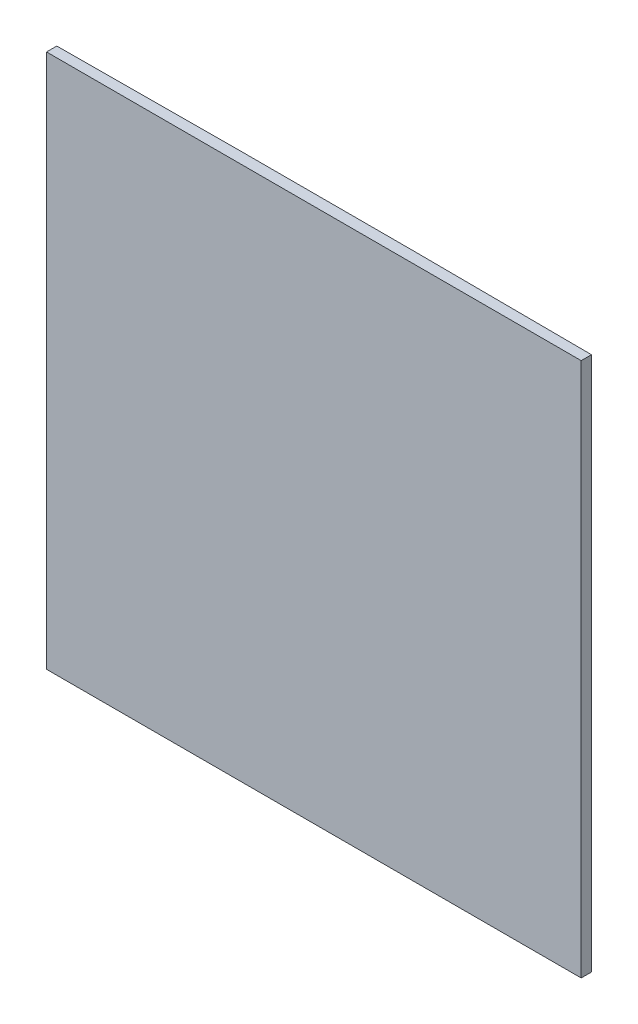
ISO-10303-21;
HEADER;
FILE_DESCRIPTION(('STEP AP214'),'2;1');
FILE_NAME('part.step','',(''),(''),'','','');
FILE_SCHEMA(('AUTOMOTIVE_DESIGN { 1 0 10303 214 1 1 1 1 }'));
ENDSEC;
DATA;
#1=APPLICATION_CONTEXT('core data for automotive mechanical design processes');
#2=APPLICATION_PROTOCOL_DEFINITION('international standard','automotive_design',2000,#1);
#3=PRODUCT_CONTEXT('',#1,'mechanical');
#4=PRODUCT('Part','Part','',(#3));
#5=PRODUCT_RELATED_PRODUCT_CATEGORY('part','',(#4));
#6=PRODUCT_DEFINITION_FORMATION('','',#4);
#7=PRODUCT_DEFINITION_CONTEXT('part definition',#1,'design');
#8=PRODUCT_DEFINITION('design','',#6,#7);
#9=PRODUCT_DEFINITION_SHAPE('','',#8);
#10=(LENGTH_UNIT() NAMED_UNIT(*) SI_UNIT(.MILLI.,.METRE.));
#11=(NAMED_UNIT(*) PLANE_ANGLE_UNIT() SI_UNIT($,.RADIAN.));
#12=(NAMED_UNIT(*) SI_UNIT($,.STERADIAN.) SOLID_ANGLE_UNIT());
#13=UNCERTAINTY_MEASURE_WITH_UNIT(LENGTH_MEASURE(1.E-05),#10,'distance_accuracy_value','');
#14=(GEOMETRIC_REPRESENTATION_CONTEXT(3) GLOBAL_UNCERTAINTY_ASSIGNED_CONTEXT((#13)) GLOBAL_UNIT_ASSIGNED_CONTEXT((#10,
#11,#12)) REPRESENTATION_CONTEXT('',''));
#15=CARTESIAN_POINT('',(0.,0.,0.));
#16=DIRECTION('',(0.,0.,1.));
#17=DIRECTION('',(1.,0.,0.));
#18=AXIS2_PLACEMENT_3D('',#15,#16,#17);
#19=CARTESIAN_POINT('',(0.,52.,-1.));
#20=DIRECTION('',(1.,0.,0.));
#21=DIRECTION('',(0.,0.,-1.));
#22=AXIS2_PLACEMENT_3D('',#19,#20,#21);
#23=PLANE('',#22);
#24=DIRECTION('',(0.,0.,1.));
#25=VECTOR('',#24,1.);
#26=CARTESIAN_POINT('',(0.,0.,-1.));
#27=LINE('',#26,#25);
#28=CARTESIAN_POINT('',(2.18575157973078E-13,0.,-1.00000000000033));
#29=VERTEX_POINT('',#28);
#30=CARTESIAN_POINT('',(0.,0.,0.));
#31=VERTEX_POINT('',#30);
#32=EDGE_CURVE('E97',#29,#31,#27,.T.);
#33=ORIENTED_EDGE('',*,*,#32,.T.);
#34=DIRECTION('',(0.,-1.,0.));
#35=VECTOR('',#34,1.);
#36=CARTESIAN_POINT('',(0.,52.,0.));
#37=LINE('',#36,#35);
#38=CARTESIAN_POINT('',(0.,52.,0.));
#39=VERTEX_POINT('',#38);
#40=EDGE_CURVE('E11',#39,#31,#37,.T.);
#41=ORIENTED_EDGE('',*,*,#40,.F.);
#42=DIRECTION('',(0.,0.,1.));
#43=VECTOR('',#42,1.);
#44=CARTESIAN_POINT('',(0.,52.,-1.));
#45=LINE('',#44,#43);
#46=CARTESIAN_POINT('',(2.18575157973078E-13,52.,-1.00000000000033));
#47=VERTEX_POINT('',#46);
#48=EDGE_CURVE('E85',#47,#39,#45,.T.);
#49=ORIENTED_EDGE('',*,*,#48,.F.);
#50=DIRECTION('',(0.,-1.,0.));
#51=VECTOR('',#50,1.);
#52=CARTESIAN_POINT('',(2.18575157973078E-13,52.,-1.00000000000033));
#53=LINE('',#52,#51);
#54=EDGE_CURVE('E93',#47,#29,#53,.T.);
#55=ORIENTED_EDGE('',*,*,#54,.T.);
#56=EDGE_LOOP('',(#33,#41,#49,#55));
#57=FACE_BOUND('',#56,.T.);
#58=ADVANCED_FACE('F34',(#57),#23,.F.);
#59=CARTESIAN_POINT('',(0.,52.,0.));
#60=DIRECTION('',(0.,0.,-1.));
#61=DIRECTION('',(-1.,0.,0.));
#62=AXIS2_PLACEMENT_3D('',#59,#60,#61);
#63=PLANE('',#62);
#64=DIRECTION('',(1.,0.,0.));
#65=VECTOR('',#64,1.);
#66=CARTESIAN_POINT('',(0.,0.,0.));
#67=LINE('',#66,#65);
#68=CARTESIAN_POINT('',(52.,0.,0.));
#69=VERTEX_POINT('',#68);
#70=EDGE_CURVE('E89',#31,#69,#67,.T.);
#71=ORIENTED_EDGE('',*,*,#70,.T.);
#72=DIRECTION('',(0.,-1.,0.));
#73=VECTOR('',#72,1.);
#74=CARTESIAN_POINT('',(52.,52.,0.));
#75=LINE('',#74,#73);
#76=CARTESIAN_POINT('',(52.,52.,0.));
#77=VERTEX_POINT('',#76);
#78=EDGE_CURVE('E42',#77,#69,#75,.T.);
#79=ORIENTED_EDGE('',*,*,#78,.F.);
#80=DIRECTION('',(1.,0.,0.));
#81=VECTOR('',#80,1.);
#82=CARTESIAN_POINT('',(0.,52.,0.));
#83=LINE('',#82,#81);
#84=EDGE_CURVE('E80',#39,#77,#83,.T.);
#85=ORIENTED_EDGE('',*,*,#84,.F.);
#86=ORIENTED_EDGE('',*,*,#40,.T.);
#87=EDGE_LOOP('',(#71,#79,#85,#86));
#88=FACE_BOUND('',#87,.T.);
#89=ADVANCED_FACE('F88',(#88),#63,.F.);
#90=CARTESIAN_POINT('',(52.,52.,0.));
#91=DIRECTION('',(-1.,0.,0.));
#92=DIRECTION('',(0.,0.,1.));
#93=AXIS2_PLACEMENT_3D('',#90,#91,#92);
#94=PLANE('',#93);
#95=DIRECTION('',(0.,0.,-1.));
#96=VECTOR('',#95,1.);
#97=CARTESIAN_POINT('',(52.,0.,0.));
#98=LINE('',#97,#96);
#99=CARTESIAN_POINT('',(52.,0.,-1.));
#100=VERTEX_POINT('',#99);
#101=EDGE_CURVE('E67',#69,#100,#98,.T.);
#102=ORIENTED_EDGE('',*,*,#101,.T.);
#103=DIRECTION('',(0.,-1.,0.));
#104=VECTOR('',#103,1.);
#105=CARTESIAN_POINT('',(52.,52.,-1.));
#106=LINE('',#105,#104);
#107=CARTESIAN_POINT('',(52.,52.,-1.));
#108=VERTEX_POINT('',#107);
#109=EDGE_CURVE('E90',#108,#100,#106,.T.);
#110=ORIENTED_EDGE('',*,*,#109,.F.);
#111=DIRECTION('',(0.,0.,-1.));
#112=VECTOR('',#111,1.);
#113=CARTESIAN_POINT('',(52.,52.,0.));
#114=LINE('',#113,#112);
#115=EDGE_CURVE('E83',#77,#108,#114,.T.);
#116=ORIENTED_EDGE('',*,*,#115,.F.);
#117=ORIENTED_EDGE('',*,*,#78,.T.);
#118=EDGE_LOOP('',(#102,#110,#116,#117));
#119=FACE_BOUND('',#118,.T.);
#120=ADVANCED_FACE('F91',(#119),#94,.F.);
#121=CARTESIAN_POINT('',(26.,52.,3378.95));
#122=DIRECTION('',(0.,-1.,0.));
#123=DIRECTION('',(0.,0.,-1.));
#124=AXIS2_PLACEMENT_3D('',#121,#122,#123);
#125=CYLINDRICAL_SURFACE('',#124,3380.05);
#126=CARTESIAN_POINT('',(26.,0.,3378.95));
#127=DIRECTION('',(0.,1.,0.));
#128=DIRECTION('',(0.,0.,1.));
#129=AXIS2_PLACEMENT_3D('',#126,#127,#128);
#130=CIRCLE('',#129,3380.05);
#131=EDGE_CURVE('E73',#100,#29,#130,.T.);
#132=ORIENTED_EDGE('',*,*,#131,.T.);
#133=ORIENTED_EDGE('',*,*,#54,.F.);
#134=CARTESIAN_POINT('',(26.,52.,3378.95));
#135=DIRECTION('',(0.,1.,0.));
#136=DIRECTION('',(0.,0.,1.));
#137=AXIS2_PLACEMENT_3D('',#134,#135,#136);
#138=CIRCLE('',#137,3380.05);
#139=EDGE_CURVE('E50',#108,#47,#138,.T.);
#140=ORIENTED_EDGE('',*,*,#139,.F.);
#141=ORIENTED_EDGE('',*,*,#109,.T.);
#142=EDGE_LOOP('',(#132,#133,#140,#141));
#143=FACE_BOUND('',#142,.T.);
#144=ADVANCED_FACE('F104',(#143),#125,.T.);
#145=CARTESIAN_POINT('',(26.,52.,3378.95));
#146=DIRECTION('',(0.,1.,0.));
#147=DIRECTION('',(0.,0.,1.));
#148=AXIS2_PLACEMENT_3D('',#145,#146,#147);
#149=PLANE('',#148);
#150=ORIENTED_EDGE('',*,*,#48,.T.);
#151=ORIENTED_EDGE('',*,*,#84,.T.);
#152=ORIENTED_EDGE('',*,*,#115,.T.);
#153=ORIENTED_EDGE('',*,*,#139,.T.);
#154=EDGE_LOOP('',(#150,#151,#152,#153));
#155=FACE_BOUND('',#154,.T.);
#156=ADVANCED_FACE('F81',(#155),#149,.T.);
#157=CARTESIAN_POINT('',(26.,0.,3378.95));
#158=DIRECTION('',(0.,1.,0.));
#159=DIRECTION('',(0.,0.,1.));
#160=AXIS2_PLACEMENT_3D('',#157,#158,#159);
#161=PLANE('',#160);
#162=ORIENTED_EDGE('',*,*,#32,.F.);
#163=ORIENTED_EDGE('',*,*,#131,.F.);
#164=ORIENTED_EDGE('',*,*,#101,.F.);
#165=ORIENTED_EDGE('',*,*,#70,.F.);
#166=EDGE_LOOP('',(#162,#163,#164,#165));
#167=FACE_BOUND('',#166,.T.);
#168=ADVANCED_FACE('F107',(#167),#161,.F.);
#169=CLOSED_SHELL('',(#58,#89,#120,#144,#156,#168));
#170=MANIFOLD_SOLID_BREP('B2',#169);
#171=ADVANCED_BREP_SHAPE_REPRESENTATION('',(#18,#170),#14);
#172=SHAPE_DEFINITION_REPRESENTATION(#9,#171);
ENDSEC;
END-ISO-10303-21;
